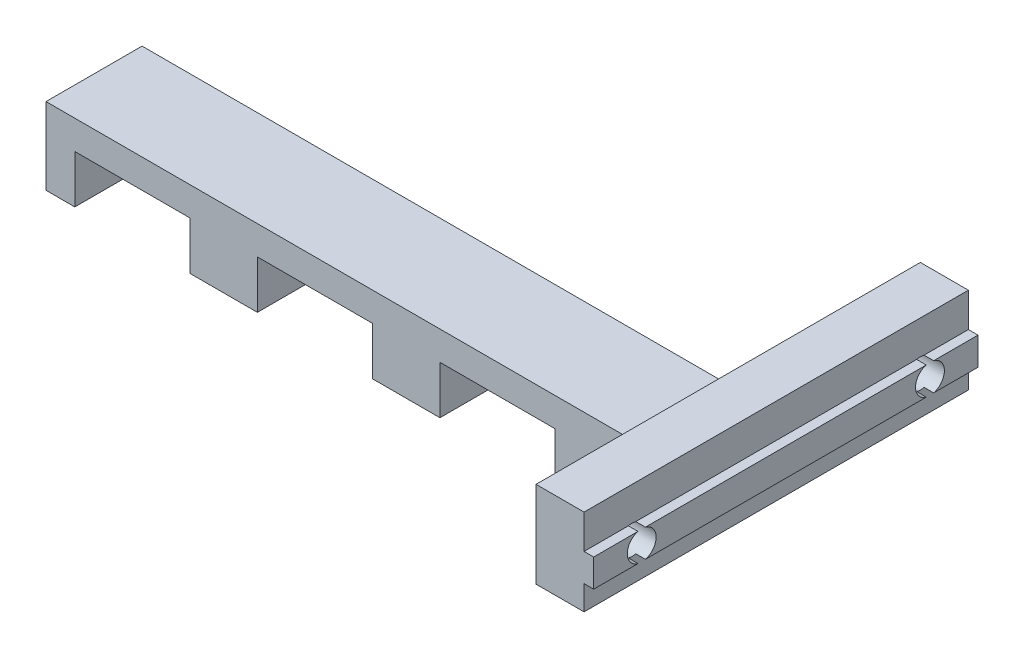
ISO-10303-21;
HEADER;
FILE_DESCRIPTION(('STEP AP214'),'2;1');
FILE_NAME('part.step','',(''),(''),'','','');
FILE_SCHEMA(('AUTOMOTIVE_DESIGN { 1 0 10303 214 1 1 1 1 }'));
ENDSEC;
DATA;
#1=APPLICATION_CONTEXT('core data for automotive mechanical design processes');
#2=APPLICATION_PROTOCOL_DEFINITION('international standard','automotive_design',2000,#1);
#3=PRODUCT_CONTEXT('',#1,'mechanical');
#4=PRODUCT('Part','Part','',(#3));
#5=PRODUCT_RELATED_PRODUCT_CATEGORY('part','',(#4));
#6=PRODUCT_DEFINITION_FORMATION('','',#4);
#7=PRODUCT_DEFINITION_CONTEXT('part definition',#1,'design');
#8=PRODUCT_DEFINITION('design','',#6,#7);
#9=PRODUCT_DEFINITION_SHAPE('','',#8);
#10=(LENGTH_UNIT() NAMED_UNIT(*) SI_UNIT(.MILLI.,.METRE.));
#11=(NAMED_UNIT(*) PLANE_ANGLE_UNIT() SI_UNIT($,.RADIAN.));
#12=(NAMED_UNIT(*) SI_UNIT($,.STERADIAN.) SOLID_ANGLE_UNIT());
#13=UNCERTAINTY_MEASURE_WITH_UNIT(LENGTH_MEASURE(1.E-05),#10,'distance_accuracy_value','');
#14=(GEOMETRIC_REPRESENTATION_CONTEXT(3) GLOBAL_UNCERTAINTY_ASSIGNED_CONTEXT((#13)) GLOBAL_UNIT_ASSIGNED_CONTEXT((#10,
#11,#12)) REPRESENTATION_CONTEXT('',''));
#15=CARTESIAN_POINT('',(0.,0.,0.));
#16=DIRECTION('',(0.,0.,1.));
#17=DIRECTION('',(1.,0.,0.));
#18=AXIS2_PLACEMENT_3D('',#15,#16,#17);
#19=CARTESIAN_POINT('',(72.,10.45,20.));
#20=DIRECTION('',(-1.,0.,0.));
#21=DIRECTION('',(0.,0.,1.));
#22=AXIS2_PLACEMENT_3D('',#19,#20,#21);
#23=PLANE('',#22);
#24=DIRECTION('',(0.,0.,-1.));
#25=VECTOR('',#24,1.);
#26=CARTESIAN_POINT('',(72.,10.45,20.));
#27=LINE('',#26,#25);
#28=CARTESIAN_POINT('',(72.,10.45,-15.3840572873934));
#29=VERTEX_POINT('',#28);
#30=CARTESIAN_POINT('',(72.,10.45,-20.));
#31=VERTEX_POINT('',#30);
#32=EDGE_CURVE('E286',#29,#31,#27,.T.);
#33=ORIENTED_EDGE('',*,*,#32,.F.);
#34=CARTESIAN_POINT('',(72.,9.,-15.));
#35=DIRECTION('',(1.,0.,0.));
#36=DIRECTION('',(0.,0.,-1.));
#37=AXIS2_PLACEMENT_3D('',#34,#35,#36);
#38=CIRCLE('',#37,1.5);
#39=CARTESIAN_POINT('',(72.,7.55,-15.3840572873934));
#40=VERTEX_POINT('',#39);
#41=EDGE_CURVE('E269',#40,#29,#38,.T.);
#42=ORIENTED_EDGE('',*,*,#41,.F.);
#43=DIRECTION('',(0.,0.,-1.));
#44=VECTOR('',#43,1.);
#45=CARTESIAN_POINT('',(72.,7.55,20.));
#46=LINE('',#45,#44);
#47=CARTESIAN_POINT('',(72.,7.55,-20.));
#48=VERTEX_POINT('',#47);
#49=EDGE_CURVE('E304',#40,#48,#46,.T.);
#50=ORIENTED_EDGE('',*,*,#49,.T.);
#51=DIRECTION('',(0.,1.,0.));
#52=VECTOR('',#51,1.);
#53=CARTESIAN_POINT('',(72.,10.45,-20.));
#54=LINE('',#53,#52);
#55=EDGE_CURVE('E292',#48,#31,#54,.T.);
#56=ORIENTED_EDGE('',*,*,#55,.T.);
#57=EDGE_LOOP('',(#33,#42,#50,#56));
#58=FACE_BOUND('',#57,.T.);
#59=ADVANCED_FACE('F33',(#58),#23,.F.);
#60=CARTESIAN_POINT('',(71.,10.45,20.));
#61=DIRECTION('',(0.,-1.,0.));
#62=DIRECTION('',(0.,0.,-1.));
#63=AXIS2_PLACEMENT_3D('',#60,#61,#62);
#64=PLANE('',#63);
#65=DIRECTION('',(0.,0.,-1.));
#66=VECTOR('',#65,1.);
#67=CARTESIAN_POINT('',(71.,10.45,20.));
#68=LINE('',#67,#66);
#69=CARTESIAN_POINT('',(71.,10.45,-15.3840572873934));
#70=VERTEX_POINT('',#69);
#71=CARTESIAN_POINT('',(71.,10.45,-20.));
#72=VERTEX_POINT('',#71);
#73=EDGE_CURVE('E288',#70,#72,#68,.T.);
#74=ORIENTED_EDGE('',*,*,#73,.F.);
#75=DIRECTION('',(1.,0.,0.));
#76=VECTOR('',#75,1.);
#77=CARTESIAN_POINT('',(42.,10.45,-15.3840572873934));
#78=LINE('',#77,#76);
#79=EDGE_CURVE('E273',#70,#29,#78,.T.);
#80=ORIENTED_EDGE('',*,*,#79,.T.);
#81=ORIENTED_EDGE('',*,*,#32,.T.);
#82=DIRECTION('',(-1.,0.,0.));
#83=VECTOR('',#82,1.);
#84=CARTESIAN_POINT('',(71.,10.45,-20.));
#85=LINE('',#84,#83);
#86=EDGE_CURVE('E515',#31,#72,#85,.T.);
#87=ORIENTED_EDGE('',*,*,#86,.T.);
#88=EDGE_LOOP('',(#74,#80,#81,#87));
#89=FACE_BOUND('',#88,.T.);
#90=ADVANCED_FACE('F284',(#89),#64,.F.);
#91=CARTESIAN_POINT('',(72.,7.55,20.));
#92=DIRECTION('',(0.,1.,0.));
#93=DIRECTION('',(0.,0.,1.));
#94=AXIS2_PLACEMENT_3D('',#91,#92,#93);
#95=PLANE('',#94);
#96=DIRECTION('',(0.,0.,-1.));
#97=VECTOR('',#96,1.);
#98=CARTESIAN_POINT('',(71.,7.55,20.));
#99=LINE('',#98,#97);
#100=CARTESIAN_POINT('',(71.,7.55,14.6159427126066));
#101=VERTEX_POINT('',#100);
#102=CARTESIAN_POINT('',(71.,7.55,-14.6159427126066));
#103=VERTEX_POINT('',#102);
#104=EDGE_CURVE('E320',#101,#103,#99,.T.);
#105=ORIENTED_EDGE('',*,*,#104,.T.);
#106=DIRECTION('',(1.,0.,0.));
#107=VECTOR('',#106,1.);
#108=CARTESIAN_POINT('',(42.,7.55,-14.6159427126066));
#109=LINE('',#108,#107);
#110=CARTESIAN_POINT('',(72.,7.55,-14.6159427126066));
#111=VERTEX_POINT('',#110);
#112=EDGE_CURVE('E545',#103,#111,#109,.T.);
#113=ORIENTED_EDGE('',*,*,#112,.T.);
#114=CARTESIAN_POINT('',(72.,7.55,14.6159427126066));
#115=VERTEX_POINT('',#114);
#116=EDGE_CURVE('E309',#115,#111,#46,.T.);
#117=ORIENTED_EDGE('',*,*,#116,.F.);
#118=DIRECTION('',(1.,0.,0.));
#119=VECTOR('',#118,1.);
#120=CARTESIAN_POINT('',(42.,7.55,14.6159427126066));
#121=LINE('',#120,#119);
#122=EDGE_CURVE('E557',#115,#101,#121,.F.);
#123=ORIENTED_EDGE('',*,*,#122,.T.);
#124=EDGE_LOOP('',(#105,#113,#117,#123));
#125=FACE_BOUND('',#124,.T.);
#126=ADVANCED_FACE('F681',(#125),#95,.F.);
#127=CARTESIAN_POINT('',(71.,7.55,20.));
#128=VERTEX_POINT('',#127);
#129=CARTESIAN_POINT('',(71.,7.55,15.3840572873934));
#130=VERTEX_POINT('',#129);
#131=EDGE_CURVE('E321',#128,#130,#99,.T.);
#132=ORIENTED_EDGE('',*,*,#131,.T.);
#133=DIRECTION('',(1.,0.,0.));
#134=VECTOR('',#133,1.);
#135=CARTESIAN_POINT('',(42.,7.55,15.3840572873934));
#136=LINE('',#135,#134);
#137=CARTESIAN_POINT('',(72.,7.55,15.3840572873934));
#138=VERTEX_POINT('',#137);
#139=EDGE_CURVE('E505',#130,#138,#136,.T.);
#140=ORIENTED_EDGE('',*,*,#139,.T.);
#141=CARTESIAN_POINT('',(72.,7.55,20.));
#142=VERTEX_POINT('',#141);
#143=EDGE_CURVE('E310',#142,#138,#46,.T.);
#144=ORIENTED_EDGE('',*,*,#143,.F.);
#145=DIRECTION('',(1.,0.,0.));
#146=VECTOR('',#145,1.);
#147=CARTESIAN_POINT('',(72.,7.55,20.));
#148=LINE('',#147,#146);
#149=EDGE_CURVE('E571',#128,#142,#148,.T.);
#150=ORIENTED_EDGE('',*,*,#149,.F.);
#151=EDGE_LOOP('',(#132,#140,#144,#150));
#152=FACE_BOUND('',#151,.T.);
#153=ADVANCED_FACE('F686',(#152),#95,.F.);
#154=ORIENTED_EDGE('',*,*,#116,.T.);
#155=CARTESIAN_POINT('',(72.,10.45,-14.6159427126066));
#156=VERTEX_POINT('',#155);
#157=EDGE_CURVE('E280',#156,#111,#38,.T.);
#158=ORIENTED_EDGE('',*,*,#157,.F.);
#159=CARTESIAN_POINT('',(72.,10.45,14.6159427126066));
#160=VERTEX_POINT('',#159);
#161=EDGE_CURVE('E294',#160,#156,#27,.T.);
#162=ORIENTED_EDGE('',*,*,#161,.F.);
#163=CARTESIAN_POINT('',(72.,9.,15.));
#164=DIRECTION('',(1.,0.,0.));
#165=DIRECTION('',(0.,0.,-1.));
#166=AXIS2_PLACEMENT_3D('',#163,#164,#165);
#167=CIRCLE('',#166,1.5);
#168=EDGE_CURVE('E551',#115,#160,#167,.T.);
#169=ORIENTED_EDGE('',*,*,#168,.F.);
#170=EDGE_LOOP('',(#154,#158,#162,#169));
#171=FACE_BOUND('',#170,.T.);
#172=ADVANCED_FACE('F676',(#171),#23,.F.);
#173=ORIENTED_EDGE('',*,*,#161,.T.);
#174=DIRECTION('',(1.,0.,0.));
#175=VECTOR('',#174,1.);
#176=CARTESIAN_POINT('',(42.,10.45,-14.6159427126066));
#177=LINE('',#176,#175);
#178=CARTESIAN_POINT('',(71.,10.45,-14.6159427126066));
#179=VERTEX_POINT('',#178);
#180=EDGE_CURVE('E289',#156,#179,#177,.F.);
#181=ORIENTED_EDGE('',*,*,#180,.T.);
#182=CARTESIAN_POINT('',(71.,10.45,14.6159427126066));
#183=VERTEX_POINT('',#182);
#184=EDGE_CURVE('E300',#183,#179,#68,.T.);
#185=ORIENTED_EDGE('',*,*,#184,.F.);
#186=DIRECTION('',(1.,0.,0.));
#187=VECTOR('',#186,1.);
#188=CARTESIAN_POINT('',(42.,10.45,14.6159427126066));
#189=LINE('',#188,#187);
#190=EDGE_CURVE('E536',#183,#160,#189,.T.);
#191=ORIENTED_EDGE('',*,*,#190,.T.);
#192=EDGE_LOOP('',(#173,#181,#185,#191));
#193=FACE_BOUND('',#192,.T.);
#194=ADVANCED_FACE('F535',(#193),#64,.F.);
#195=CARTESIAN_POINT('',(71.,5.,5.));
#196=DIRECTION('',(-1.,0.,0.));
#197=DIRECTION('',(0.,0.,1.));
#198=AXIS2_PLACEMENT_3D('',#195,#196,#197);
#199=PLANE('',#198);
#200=CARTESIAN_POINT('',(71.,7.55,-15.3840572873934));
#201=VERTEX_POINT('',#200);
#202=CARTESIAN_POINT('',(71.,7.55,-20.));
#203=VERTEX_POINT('',#202);
#204=EDGE_CURVE('E315',#201,#203,#99,.T.);
#205=ORIENTED_EDGE('',*,*,#204,.F.);
#206=CARTESIAN_POINT('',(71.,9.,-15.));
#207=DIRECTION('',(-1.,0.,0.));
#208=DIRECTION('',(0.,0.,1.));
#209=AXIS2_PLACEMENT_3D('',#206,#207,#208);
#210=CIRCLE('',#209,1.5);
#211=EDGE_CURVE('E542',#201,#103,#210,.T.);
#212=ORIENTED_EDGE('',*,*,#211,.T.);
#213=ORIENTED_EDGE('',*,*,#104,.F.);
#214=CARTESIAN_POINT('',(71.,9.,15.));
#215=DIRECTION('',(-1.,0.,0.));
#216=DIRECTION('',(0.,0.,1.));
#217=AXIS2_PLACEMENT_3D('',#214,#215,#216);
#218=CIRCLE('',#217,1.5);
#219=EDGE_CURVE('E560',#101,#130,#218,.T.);
#220=ORIENTED_EDGE('',*,*,#219,.T.);
#221=ORIENTED_EDGE('',*,*,#131,.F.);
#222=DIRECTION('',(0.,1.,0.));
#223=VECTOR('',#222,1.);
#224=CARTESIAN_POINT('',(71.,7.55,20.));
#225=LINE('',#224,#223);
#226=CARTESIAN_POINT('',(71.,5.,20.));
#227=VERTEX_POINT('',#226);
#228=EDGE_CURVE('E569',#227,#128,#225,.T.);
#229=ORIENTED_EDGE('',*,*,#228,.F.);
#230=DIRECTION('',(0.,0.,-1.));
#231=VECTOR('',#230,1.);
#232=CARTESIAN_POINT('',(71.,5.,5.));
#233=LINE('',#232,#231);
#234=CARTESIAN_POINT('',(71.,5.,-20.));
#235=VERTEX_POINT('',#234);
#236=EDGE_CURVE('E414',#227,#235,#233,.T.);
#237=ORIENTED_EDGE('',*,*,#236,.T.);
#238=DIRECTION('',(0.,1.,0.));
#239=VECTOR('',#238,1.);
#240=CARTESIAN_POINT('',(71.,7.55,-20.));
#241=LINE('',#240,#239);
#242=EDGE_CURVE('E502',#235,#203,#241,.T.);
#243=ORIENTED_EDGE('',*,*,#242,.T.);
#244=EDGE_LOOP('',(#205,#212,#213,#220,#221,#229,#237,#243));
#245=FACE_BOUND('',#244,.T.);
#246=ADVANCED_FACE('F716',(#245),#199,.F.);
#247=CARTESIAN_POINT('',(71.,8.00000000000001,5.));
#248=DIRECTION('',(0.,-1.,0.));
#249=DIRECTION('',(1.,0.,0.));
#250=AXIS2_PLACEMENT_3D('',#247,#248,#249);
#251=PLANE('',#250);
#252=DIRECTION('',(-1.,0.,0.));
#253=VECTOR('',#252,1.);
#254=CARTESIAN_POINT('',(71.,8.00000000000001,5.));
#255=LINE('',#254,#253);
#256=CARTESIAN_POINT('',(61.,8.00000000000001,5.));
#257=VERTEX_POINT('',#256);
#258=CARTESIAN_POINT('',(0.,8.,5.));
#259=VERTEX_POINT('',#258);
#260=EDGE_CURVE('E371',#257,#259,#255,.T.);
#261=ORIENTED_EDGE('',*,*,#260,.F.);
#262=DIRECTION('',(0.,0.,1.));
#263=VECTOR('',#262,1.);
#264=CARTESIAN_POINT('',(61.,8.00000000000001,-5.));
#265=LINE('',#264,#263);
#266=CARTESIAN_POINT('',(61.,8.00000000000001,-5.));
#267=VERTEX_POINT('',#266);
#268=EDGE_CURVE('E470',#257,#267,#265,.F.);
#269=ORIENTED_EDGE('',*,*,#268,.T.);
#270=DIRECTION('',(-1.,0.,0.));
#271=VECTOR('',#270,1.);
#272=CARTESIAN_POINT('',(71.,8.00000000000001,-5.));
#273=LINE('',#272,#271);
#274=CARTESIAN_POINT('',(0.,8.,-5.));
#275=VERTEX_POINT('',#274);
#276=EDGE_CURVE('E406',#267,#275,#273,.T.);
#277=ORIENTED_EDGE('',*,*,#276,.T.);
#278=DIRECTION('',(0.,0.,-1.));
#279=VECTOR('',#278,1.);
#280=CARTESIAN_POINT('',(0.,8.,5.));
#281=LINE('',#280,#279);
#282=EDGE_CURVE('E411',#259,#275,#281,.T.);
#283=ORIENTED_EDGE('',*,*,#282,.F.);
#284=EDGE_LOOP('',(#261,#269,#277,#283));
#285=FACE_BOUND('',#284,.T.);
#286=ADVANCED_FACE('F590',(#285),#251,.F.);
#287=CARTESIAN_POINT('',(0.,0.,5.));
#288=DIRECTION('',(0.,0.,1.));
#289=DIRECTION('',(1.,0.,0.));
#290=AXIS2_PLACEMENT_3D('',#287,#288,#289);
#291=PLANE('',#290);
#292=DIRECTION('',(1.,0.,0.));
#293=VECTOR('',#292,1.);
#294=CARTESIAN_POINT('',(60.,5.,5.));
#295=LINE('',#294,#293);
#296=CARTESIAN_POINT('',(60.,5.,5.));
#297=VERTEX_POINT('',#296);
#298=CARTESIAN_POINT('',(61.,5.,5.));
#299=VERTEX_POINT('',#298);
#300=EDGE_CURVE('E369',#297,#299,#295,.T.);
#301=ORIENTED_EDGE('',*,*,#300,.T.);
#302=DIRECTION('',(0.,1.,0.));
#303=VECTOR('',#302,1.);
#304=CARTESIAN_POINT('',(61.,0.,5.));
#305=LINE('',#304,#303);
#306=EDGE_CURVE('E472',#299,#257,#305,.T.);
#307=ORIENTED_EDGE('',*,*,#306,.T.);
#308=ORIENTED_EDGE('',*,*,#260,.T.);
#309=DIRECTION('',(0.,-1.,0.));
#310=VECTOR('',#309,1.);
#311=CARTESIAN_POINT('',(0.,8.,5.));
#312=LINE('',#311,#310);
#313=CARTESIAN_POINT('',(0.,0.,5.));
#314=VERTEX_POINT('',#313);
#315=EDGE_CURVE('E373',#259,#314,#312,.T.);
#316=ORIENTED_EDGE('',*,*,#315,.T.);
#317=DIRECTION('',(1.,0.,0.));
#318=VECTOR('',#317,1.);
#319=CARTESIAN_POINT('',(0.,0.,5.));
#320=LINE('',#319,#318);
#321=CARTESIAN_POINT('',(3.,0.,5.));
#322=VERTEX_POINT('',#321);
#323=EDGE_CURVE('E339',#314,#322,#320,.T.);
#324=ORIENTED_EDGE('',*,*,#323,.T.);
#325=DIRECTION('',(0.,1.,0.));
#326=VECTOR('',#325,1.);
#327=CARTESIAN_POINT('',(3.,0.,5.));
#328=LINE('',#327,#326);
#329=CARTESIAN_POINT('',(3.,5.,5.));
#330=VERTEX_POINT('',#329);
#331=EDGE_CURVE('E342',#322,#330,#328,.T.);
#332=ORIENTED_EDGE('',*,*,#331,.T.);
#333=DIRECTION('',(1.,0.,0.));
#334=VECTOR('',#333,1.);
#335=CARTESIAN_POINT('',(3.,5.,5.));
#336=LINE('',#335,#334);
#337=CARTESIAN_POINT('',(15.,5.,5.));
#338=VERTEX_POINT('',#337);
#339=EDGE_CURVE('E345',#330,#338,#336,.T.);
#340=ORIENTED_EDGE('',*,*,#339,.T.);
#341=DIRECTION('',(0.,-1.,0.));
#342=VECTOR('',#341,1.);
#343=CARTESIAN_POINT('',(15.,5.,5.));
#344=LINE('',#343,#342);
#345=CARTESIAN_POINT('',(15.,0.,5.));
#346=VERTEX_POINT('',#345);
#347=EDGE_CURVE('E347',#338,#346,#344,.T.);
#348=ORIENTED_EDGE('',*,*,#347,.T.);
#349=DIRECTION('',(1.,0.,0.));
#350=VECTOR('',#349,1.);
#351=CARTESIAN_POINT('',(15.,0.,5.));
#352=LINE('',#351,#350);
#353=CARTESIAN_POINT('',(22.,0.,5.));
#354=VERTEX_POINT('',#353);
#355=EDGE_CURVE('E349',#346,#354,#352,.T.);
#356=ORIENTED_EDGE('',*,*,#355,.T.);
#357=DIRECTION('',(0.,1.,0.));
#358=VECTOR('',#357,1.);
#359=CARTESIAN_POINT('',(22.,0.,5.));
#360=LINE('',#359,#358);
#361=CARTESIAN_POINT('',(22.,5.,5.));
#362=VERTEX_POINT('',#361);
#363=EDGE_CURVE('E351',#354,#362,#360,.T.);
#364=ORIENTED_EDGE('',*,*,#363,.T.);
#365=DIRECTION('',(1.,0.,0.));
#366=VECTOR('',#365,1.);
#367=CARTESIAN_POINT('',(22.,5.,5.));
#368=LINE('',#367,#366);
#369=CARTESIAN_POINT('',(34.,5.,5.));
#370=VERTEX_POINT('',#369);
#371=EDGE_CURVE('E353',#362,#370,#368,.T.);
#372=ORIENTED_EDGE('',*,*,#371,.T.);
#373=DIRECTION('',(0.,-1.,0.));
#374=VECTOR('',#373,1.);
#375=CARTESIAN_POINT('',(34.,5.,5.));
#376=LINE('',#375,#374);
#377=CARTESIAN_POINT('',(34.,0.,5.));
#378=VERTEX_POINT('',#377);
#379=EDGE_CURVE('E355',#370,#378,#376,.T.);
#380=ORIENTED_EDGE('',*,*,#379,.T.);
#381=DIRECTION('',(1.,0.,0.));
#382=VECTOR('',#381,1.);
#383=CARTESIAN_POINT('',(34.,0.,5.));
#384=LINE('',#383,#382);
#385=CARTESIAN_POINT('',(41.,0.,5.));
#386=VERTEX_POINT('',#385);
#387=EDGE_CURVE('E357',#378,#386,#384,.T.);
#388=ORIENTED_EDGE('',*,*,#387,.T.);
#389=DIRECTION('',(0.,1.,0.));
#390=VECTOR('',#389,1.);
#391=CARTESIAN_POINT('',(41.,0.,5.));
#392=LINE('',#391,#390);
#393=CARTESIAN_POINT('',(41.,5.,5.));
#394=VERTEX_POINT('',#393);
#395=EDGE_CURVE('E359',#386,#394,#392,.T.);
#396=ORIENTED_EDGE('',*,*,#395,.T.);
#397=DIRECTION('',(1.,0.,0.));
#398=VECTOR('',#397,1.);
#399=CARTESIAN_POINT('',(41.,5.,5.));
#400=LINE('',#399,#398);
#401=CARTESIAN_POINT('',(53.,5.,5.));
#402=VERTEX_POINT('',#401);
#403=EDGE_CURVE('E361',#394,#402,#400,.T.);
#404=ORIENTED_EDGE('',*,*,#403,.T.);
#405=DIRECTION('',(0.,-1.,0.));
#406=VECTOR('',#405,1.);
#407=CARTESIAN_POINT('',(53.,5.,5.));
#408=LINE('',#407,#406);
#409=CARTESIAN_POINT('',(53.,0.,5.));
#410=VERTEX_POINT('',#409);
#411=EDGE_CURVE('E363',#402,#410,#408,.T.);
#412=ORIENTED_EDGE('',*,*,#411,.T.);
#413=DIRECTION('',(1.,0.,0.));
#414=VECTOR('',#413,1.);
#415=CARTESIAN_POINT('',(53.,0.,5.));
#416=LINE('',#415,#414);
#417=CARTESIAN_POINT('',(60.,0.,5.));
#418=VERTEX_POINT('',#417);
#419=EDGE_CURVE('E365',#410,#418,#416,.T.);
#420=ORIENTED_EDGE('',*,*,#419,.T.);
#421=DIRECTION('',(0.,1.,0.));
#422=VECTOR('',#421,1.);
#423=CARTESIAN_POINT('',(60.,0.,5.));
#424=LINE('',#423,#422);
#425=EDGE_CURVE('E367',#418,#297,#424,.T.);
#426=ORIENTED_EDGE('',*,*,#425,.T.);
#427=EDGE_LOOP('',(#301,#307,#308,#316,#324,#332,#340,#348,#356,#364,#372,#380,#388,#396,#404,
#412,#420,#426));
#428=FACE_BOUND('',#427,.T.);
#429=ADVANCED_FACE('F587',(#428),#291,.T.);
#430=CARTESIAN_POINT('',(0.,0.,-5.));
#431=DIRECTION('',(0.,0.,1.));
#432=DIRECTION('',(1.,0.,0.));
#433=AXIS2_PLACEMENT_3D('',#430,#431,#432);
#434=PLANE('',#433);
#435=ORIENTED_EDGE('',*,*,#276,.F.);
#436=DIRECTION('',(0.,1.,0.));
#437=VECTOR('',#436,1.);
#438=CARTESIAN_POINT('',(61.,5.,-5.));
#439=LINE('',#438,#437);
#440=CARTESIAN_POINT('',(61.,5.,-5.));
#441=VERTEX_POINT('',#440);
#442=EDGE_CURVE('E50',#267,#441,#439,.F.);
#443=ORIENTED_EDGE('',*,*,#442,.T.);
#444=DIRECTION('',(1.,0.,0.));
#445=VECTOR('',#444,1.);
#446=CARTESIAN_POINT('',(60.,5.,-5.));
#447=LINE('',#446,#445);
#448=CARTESIAN_POINT('',(60.,5.,-5.));
#449=VERTEX_POINT('',#448);
#450=EDGE_CURVE('E404',#449,#441,#447,.T.);
#451=ORIENTED_EDGE('',*,*,#450,.F.);
#452=DIRECTION('',(0.,1.,0.));
#453=VECTOR('',#452,1.);
#454=CARTESIAN_POINT('',(60.,0.,-5.));
#455=LINE('',#454,#453);
#456=CARTESIAN_POINT('',(60.,0.,-5.));
#457=VERTEX_POINT('',#456);
#458=EDGE_CURVE('E402',#457,#449,#455,.T.);
#459=ORIENTED_EDGE('',*,*,#458,.F.);
#460=DIRECTION('',(1.,0.,0.));
#461=VECTOR('',#460,1.);
#462=CARTESIAN_POINT('',(53.,0.,-5.));
#463=LINE('',#462,#461);
#464=CARTESIAN_POINT('',(53.,0.,-5.));
#465=VERTEX_POINT('',#464);
#466=EDGE_CURVE('E400',#465,#457,#463,.T.);
#467=ORIENTED_EDGE('',*,*,#466,.F.);
#468=DIRECTION('',(0.,-1.,0.));
#469=VECTOR('',#468,1.);
#470=CARTESIAN_POINT('',(53.,5.,-5.));
#471=LINE('',#470,#469);
#472=CARTESIAN_POINT('',(53.,5.,-5.));
#473=VERTEX_POINT('',#472);
#474=EDGE_CURVE('E398',#473,#465,#471,.T.);
#475=ORIENTED_EDGE('',*,*,#474,.F.);
#476=DIRECTION('',(1.,0.,0.));
#477=VECTOR('',#476,1.);
#478=CARTESIAN_POINT('',(41.,5.,-5.));
#479=LINE('',#478,#477);
#480=CARTESIAN_POINT('',(41.,5.,-5.));
#481=VERTEX_POINT('',#480);
#482=EDGE_CURVE('E396',#481,#473,#479,.T.);
#483=ORIENTED_EDGE('',*,*,#482,.F.);
#484=DIRECTION('',(0.,1.,0.));
#485=VECTOR('',#484,1.);
#486=CARTESIAN_POINT('',(41.,0.,-5.));
#487=LINE('',#486,#485);
#488=CARTESIAN_POINT('',(41.,0.,-5.));
#489=VERTEX_POINT('',#488);
#490=EDGE_CURVE('E394',#489,#481,#487,.T.);
#491=ORIENTED_EDGE('',*,*,#490,.F.);
#492=DIRECTION('',(1.,0.,0.));
#493=VECTOR('',#492,1.);
#494=CARTESIAN_POINT('',(34.,0.,-5.));
#495=LINE('',#494,#493);
#496=CARTESIAN_POINT('',(34.,0.,-5.));
#497=VERTEX_POINT('',#496);
#498=EDGE_CURVE('E392',#497,#489,#495,.T.);
#499=ORIENTED_EDGE('',*,*,#498,.F.);
#500=DIRECTION('',(0.,-1.,0.));
#501=VECTOR('',#500,1.);
#502=CARTESIAN_POINT('',(34.,5.,-5.));
#503=LINE('',#502,#501);
#504=CARTESIAN_POINT('',(34.,5.,-5.));
#505=VERTEX_POINT('',#504);
#506=EDGE_CURVE('E390',#505,#497,#503,.T.);
#507=ORIENTED_EDGE('',*,*,#506,.F.);
#508=DIRECTION('',(1.,0.,0.));
#509=VECTOR('',#508,1.);
#510=CARTESIAN_POINT('',(22.,5.,-5.));
#511=LINE('',#510,#509);
#512=CARTESIAN_POINT('',(22.,5.,-5.));
#513=VERTEX_POINT('',#512);
#514=EDGE_CURVE('E388',#513,#505,#511,.T.);
#515=ORIENTED_EDGE('',*,*,#514,.F.);
#516=DIRECTION('',(0.,1.,0.));
#517=VECTOR('',#516,1.);
#518=CARTESIAN_POINT('',(22.,0.,-5.));
#519=LINE('',#518,#517);
#520=CARTESIAN_POINT('',(22.,0.,-5.));
#521=VERTEX_POINT('',#520);
#522=EDGE_CURVE('E386',#521,#513,#519,.T.);
#523=ORIENTED_EDGE('',*,*,#522,.F.);
#524=DIRECTION('',(1.,0.,0.));
#525=VECTOR('',#524,1.);
#526=CARTESIAN_POINT('',(15.,0.,-5.));
#527=LINE('',#526,#525);
#528=CARTESIAN_POINT('',(15.,0.,-5.));
#529=VERTEX_POINT('',#528);
#530=EDGE_CURVE('E384',#529,#521,#527,.T.);
#531=ORIENTED_EDGE('',*,*,#530,.F.);
#532=DIRECTION('',(0.,-1.,0.));
#533=VECTOR('',#532,1.);
#534=CARTESIAN_POINT('',(15.,5.,-5.));
#535=LINE('',#534,#533);
#536=CARTESIAN_POINT('',(15.,5.,-5.));
#537=VERTEX_POINT('',#536);
#538=EDGE_CURVE('E382',#537,#529,#535,.T.);
#539=ORIENTED_EDGE('',*,*,#538,.F.);
#540=DIRECTION('',(1.,0.,0.));
#541=VECTOR('',#540,1.);
#542=CARTESIAN_POINT('',(3.,5.,-5.));
#543=LINE('',#542,#541);
#544=CARTESIAN_POINT('',(3.,5.,-5.));
#545=VERTEX_POINT('',#544);
#546=EDGE_CURVE('E380',#545,#537,#543,.T.);
#547=ORIENTED_EDGE('',*,*,#546,.F.);
#548=DIRECTION('',(0.,1.,0.));
#549=VECTOR('',#548,1.);
#550=CARTESIAN_POINT('',(3.,0.,-5.));
#551=LINE('',#550,#549);
#552=CARTESIAN_POINT('',(3.,0.,-5.));
#553=VERTEX_POINT('',#552);
#554=EDGE_CURVE('E378',#553,#545,#551,.T.);
#555=ORIENTED_EDGE('',*,*,#554,.F.);
#556=DIRECTION('',(1.,0.,0.));
#557=VECTOR('',#556,1.);
#558=CARTESIAN_POINT('',(0.,0.,-5.));
#559=LINE('',#558,#557);
#560=CARTESIAN_POINT('',(0.,0.,-5.));
#561=VERTEX_POINT('',#560);
#562=EDGE_CURVE('E337',#561,#553,#559,.T.);
#563=ORIENTED_EDGE('',*,*,#562,.F.);
#564=DIRECTION('',(0.,-1.,0.));
#565=VECTOR('',#564,1.);
#566=CARTESIAN_POINT('',(0.,8.,-5.));
#567=LINE('',#566,#565);
#568=EDGE_CURVE('E343',#275,#561,#567,.T.);
#569=ORIENTED_EDGE('',*,*,#568,.F.);
#570=EDGE_LOOP('',(#435,#443,#451,#459,#467,#475,#483,#491,#499,#507,#515,#523,#531,#539,#547,
#555,#563,#569));
#571=FACE_BOUND('',#570,.T.);
#572=ADVANCED_FACE('F664',(#571),#434,.F.);
#573=CARTESIAN_POINT('',(0.,0.,5.));
#574=DIRECTION('',(0.,1.,0.));
#575=DIRECTION('',(0.,0.,1.));
#576=AXIS2_PLACEMENT_3D('',#573,#574,#575);
#577=PLANE('',#576);
#578=ORIENTED_EDGE('',*,*,#562,.T.);
#579=DIRECTION('',(0.,0.,-1.));
#580=VECTOR('',#579,1.);
#581=CARTESIAN_POINT('',(3.,0.,5.));
#582=LINE('',#581,#580);
#583=EDGE_CURVE('E455',#322,#553,#582,.T.);
#584=ORIENTED_EDGE('',*,*,#583,.F.);
#585=ORIENTED_EDGE('',*,*,#323,.F.);
#586=DIRECTION('',(0.,0.,-1.));
#587=VECTOR('',#586,1.);
#588=CARTESIAN_POINT('',(0.,0.,5.));
#589=LINE('',#588,#587);
#590=EDGE_CURVE('E375',#314,#561,#589,.T.);
#591=ORIENTED_EDGE('',*,*,#590,.T.);
#592=EDGE_LOOP('',(#578,#584,#585,#591));
#593=FACE_BOUND('',#592,.T.);
#594=ADVANCED_FACE('F600',(#593),#577,.F.);
#595=CARTESIAN_POINT('',(3.,0.,5.));
#596=DIRECTION('',(-1.,0.,0.));
#597=DIRECTION('',(0.,0.,1.));
#598=AXIS2_PLACEMENT_3D('',#595,#596,#597);
#599=PLANE('',#598);
#600=ORIENTED_EDGE('',*,*,#554,.T.);
#601=DIRECTION('',(0.,0.,-1.));
#602=VECTOR('',#601,1.);
#603=CARTESIAN_POINT('',(3.,5.,5.));
#604=LINE('',#603,#602);
#605=EDGE_CURVE('E452',#330,#545,#604,.T.);
#606=ORIENTED_EDGE('',*,*,#605,.F.);
#607=ORIENTED_EDGE('',*,*,#331,.F.);
#608=ORIENTED_EDGE('',*,*,#583,.T.);
#609=EDGE_LOOP('',(#600,#606,#607,#608));
#610=FACE_BOUND('',#609,.T.);
#611=ADVANCED_FACE('F603',(#610),#599,.F.);
#612=CARTESIAN_POINT('',(3.,5.,5.));
#613=DIRECTION('',(0.,1.,0.));
#614=DIRECTION('',(0.,0.,1.));
#615=AXIS2_PLACEMENT_3D('',#612,#613,#614);
#616=PLANE('',#615);
#617=ORIENTED_EDGE('',*,*,#546,.T.);
#618=DIRECTION('',(0.,0.,-1.));
#619=VECTOR('',#618,1.);
#620=CARTESIAN_POINT('',(15.,5.,5.));
#621=LINE('',#620,#619);
#622=EDGE_CURVE('E449',#338,#537,#621,.T.);
#623=ORIENTED_EDGE('',*,*,#622,.F.);
#624=ORIENTED_EDGE('',*,*,#339,.F.);
#625=ORIENTED_EDGE('',*,*,#605,.T.);
#626=EDGE_LOOP('',(#617,#623,#624,#625));
#627=FACE_BOUND('',#626,.T.);
#628=ADVANCED_FACE('F608',(#627),#616,.F.);
#629=CARTESIAN_POINT('',(15.,5.,5.));
#630=DIRECTION('',(1.,0.,0.));
#631=DIRECTION('',(0.,1.,0.));
#632=AXIS2_PLACEMENT_3D('',#629,#630,#631);
#633=PLANE('',#632);
#634=ORIENTED_EDGE('',*,*,#538,.T.);
#635=DIRECTION('',(0.,0.,-1.));
#636=VECTOR('',#635,1.);
#637=CARTESIAN_POINT('',(15.,0.,5.));
#638=LINE('',#637,#636);
#639=EDGE_CURVE('E446',#346,#529,#638,.T.);
#640=ORIENTED_EDGE('',*,*,#639,.F.);
#641=ORIENTED_EDGE('',*,*,#347,.F.);
#642=ORIENTED_EDGE('',*,*,#622,.T.);
#643=EDGE_LOOP('',(#634,#640,#641,#642));
#644=FACE_BOUND('',#643,.T.);
#645=ADVANCED_FACE('F614',(#644),#633,.F.);
#646=CARTESIAN_POINT('',(15.,0.,5.));
#647=DIRECTION('',(0.,1.,0.));
#648=DIRECTION('',(-1.,0.,0.));
#649=AXIS2_PLACEMENT_3D('',#646,#647,#648);
#650=PLANE('',#649);
#651=ORIENTED_EDGE('',*,*,#530,.T.);
#652=DIRECTION('',(0.,0.,-1.));
#653=VECTOR('',#652,1.);
#654=CARTESIAN_POINT('',(22.,0.,5.));
#655=LINE('',#654,#653);
#656=EDGE_CURVE('E443',#354,#521,#655,.T.);
#657=ORIENTED_EDGE('',*,*,#656,.F.);
#658=ORIENTED_EDGE('',*,*,#355,.F.);
#659=ORIENTED_EDGE('',*,*,#639,.T.);
#660=EDGE_LOOP('',(#651,#657,#658,#659));
#661=FACE_BOUND('',#660,.T.);
#662=ADVANCED_FACE('F618',(#661),#650,.F.);
#663=CARTESIAN_POINT('',(22.,0.,5.));
#664=DIRECTION('',(-1.,0.,0.));
#665=DIRECTION('',(0.,-1.,0.));
#666=AXIS2_PLACEMENT_3D('',#663,#664,#665);
#667=PLANE('',#666);
#668=ORIENTED_EDGE('',*,*,#522,.T.);
#669=DIRECTION('',(0.,0.,-1.));
#670=VECTOR('',#669,1.);
#671=CARTESIAN_POINT('',(22.,5.,5.));
#672=LINE('',#671,#670);
#673=EDGE_CURVE('E440',#362,#513,#672,.T.);
#674=ORIENTED_EDGE('',*,*,#673,.F.);
#675=ORIENTED_EDGE('',*,*,#363,.F.);
#676=ORIENTED_EDGE('',*,*,#656,.T.);
#677=EDGE_LOOP('',(#668,#674,#675,#676));
#678=FACE_BOUND('',#677,.T.);
#679=ADVANCED_FACE('F623',(#678),#667,.F.);
#680=CARTESIAN_POINT('',(22.,5.,5.));
#681=DIRECTION('',(0.,1.,0.));
#682=DIRECTION('',(0.,0.,1.));
#683=AXIS2_PLACEMENT_3D('',#680,#681,#682);
#684=PLANE('',#683);
#685=ORIENTED_EDGE('',*,*,#514,.T.);
#686=DIRECTION('',(0.,0.,-1.));
#687=VECTOR('',#686,1.);
#688=CARTESIAN_POINT('',(34.,5.,5.));
#689=LINE('',#688,#687);
#690=EDGE_CURVE('E437',#370,#505,#689,.T.);
#691=ORIENTED_EDGE('',*,*,#690,.F.);
#692=ORIENTED_EDGE('',*,*,#371,.F.);
#693=ORIENTED_EDGE('',*,*,#673,.T.);
#694=EDGE_LOOP('',(#685,#691,#692,#693));
#695=FACE_BOUND('',#694,.T.);
#696=ADVANCED_FACE('F629',(#695),#684,.F.);
#697=CARTESIAN_POINT('',(34.,5.,5.));
#698=DIRECTION('',(1.,0.,0.));
#699=DIRECTION('',(0.,1.,0.));
#700=AXIS2_PLACEMENT_3D('',#697,#698,#699);
#701=PLANE('',#700);
#702=ORIENTED_EDGE('',*,*,#506,.T.);
#703=DIRECTION('',(0.,0.,-1.));
#704=VECTOR('',#703,1.);
#705=CARTESIAN_POINT('',(34.,0.,5.));
#706=LINE('',#705,#704);
#707=EDGE_CURVE('E434',#378,#497,#706,.T.);
#708=ORIENTED_EDGE('',*,*,#707,.F.);
#709=ORIENTED_EDGE('',*,*,#379,.F.);
#710=ORIENTED_EDGE('',*,*,#690,.T.);
#711=EDGE_LOOP('',(#702,#708,#709,#710));
#712=FACE_BOUND('',#711,.T.);
#713=ADVANCED_FACE('F633',(#712),#701,.F.);
#714=CARTESIAN_POINT('',(34.,0.,5.));
#715=DIRECTION('',(0.,1.,0.));
#716=DIRECTION('',(0.,0.,1.));
#717=AXIS2_PLACEMENT_3D('',#714,#715,#716);
#718=PLANE('',#717);
#719=ORIENTED_EDGE('',*,*,#498,.T.);
#720=DIRECTION('',(0.,0.,-1.));
#721=VECTOR('',#720,1.);
#722=CARTESIAN_POINT('',(41.,0.,5.));
#723=LINE('',#722,#721);
#724=EDGE_CURVE('E431',#386,#489,#723,.T.);
#725=ORIENTED_EDGE('',*,*,#724,.F.);
#726=ORIENTED_EDGE('',*,*,#387,.F.);
#727=ORIENTED_EDGE('',*,*,#707,.T.);
#728=EDGE_LOOP('',(#719,#725,#726,#727));
#729=FACE_BOUND('',#728,.T.);
#730=ADVANCED_FACE('F638',(#729),#718,.F.);
#731=CARTESIAN_POINT('',(41.,0.,5.));
#732=DIRECTION('',(-1.,0.,0.));
#733=DIRECTION('',(0.,-1.,0.));
#734=AXIS2_PLACEMENT_3D('',#731,#732,#733);
#735=PLANE('',#734);
#736=ORIENTED_EDGE('',*,*,#490,.T.);
#737=DIRECTION('',(0.,0.,-1.));
#738=VECTOR('',#737,1.);
#739=CARTESIAN_POINT('',(41.,5.,5.));
#740=LINE('',#739,#738);
#741=EDGE_CURVE('E428',#394,#481,#740,.T.);
#742=ORIENTED_EDGE('',*,*,#741,.F.);
#743=ORIENTED_EDGE('',*,*,#395,.F.);
#744=ORIENTED_EDGE('',*,*,#724,.T.);
#745=EDGE_LOOP('',(#736,#742,#743,#744));
#746=FACE_BOUND('',#745,.T.);
#747=ADVANCED_FACE('F644',(#746),#735,.F.);
#748=CARTESIAN_POINT('',(41.,5.,5.));
#749=DIRECTION('',(0.,1.,0.));
#750=DIRECTION('',(0.,0.,1.));
#751=AXIS2_PLACEMENT_3D('',#748,#749,#750);
#752=PLANE('',#751);
#753=ORIENTED_EDGE('',*,*,#482,.T.);
#754=DIRECTION('',(0.,0.,-1.));
#755=VECTOR('',#754,1.);
#756=CARTESIAN_POINT('',(53.,5.,5.));
#757=LINE('',#756,#755);
#758=EDGE_CURVE('E425',#402,#473,#757,.T.);
#759=ORIENTED_EDGE('',*,*,#758,.F.);
#760=ORIENTED_EDGE('',*,*,#403,.F.);
#761=ORIENTED_EDGE('',*,*,#741,.T.);
#762=EDGE_LOOP('',(#753,#759,#760,#761));
#763=FACE_BOUND('',#762,.T.);
#764=ADVANCED_FACE('F648',(#763),#752,.F.);
#765=CARTESIAN_POINT('',(53.,5.,5.));
#766=DIRECTION('',(1.,0.,0.));
#767=DIRECTION('',(0.,1.,0.));
#768=AXIS2_PLACEMENT_3D('',#765,#766,#767);
#769=PLANE('',#768);
#770=ORIENTED_EDGE('',*,*,#474,.T.);
#771=DIRECTION('',(0.,0.,-1.));
#772=VECTOR('',#771,1.);
#773=CARTESIAN_POINT('',(53.,0.,5.));
#774=LINE('',#773,#772);
#775=EDGE_CURVE('E422',#410,#465,#774,.T.);
#776=ORIENTED_EDGE('',*,*,#775,.F.);
#777=ORIENTED_EDGE('',*,*,#411,.F.);
#778=ORIENTED_EDGE('',*,*,#758,.T.);
#779=EDGE_LOOP('',(#770,#776,#777,#778));
#780=FACE_BOUND('',#779,.T.);
#781=ADVANCED_FACE('F653',(#780),#769,.F.);
#782=CARTESIAN_POINT('',(53.,0.,5.));
#783=DIRECTION('',(0.,1.,0.));
#784=DIRECTION('',(0.,0.,1.));
#785=AXIS2_PLACEMENT_3D('',#782,#783,#784);
#786=PLANE('',#785);
#787=ORIENTED_EDGE('',*,*,#466,.T.);
#788=DIRECTION('',(0.,0.,-1.));
#789=VECTOR('',#788,1.);
#790=CARTESIAN_POINT('',(60.,0.,5.));
#791=LINE('',#790,#789);
#792=EDGE_CURVE('E419',#418,#457,#791,.T.);
#793=ORIENTED_EDGE('',*,*,#792,.F.);
#794=ORIENTED_EDGE('',*,*,#419,.F.);
#795=ORIENTED_EDGE('',*,*,#775,.T.);
#796=EDGE_LOOP('',(#787,#793,#794,#795));
#797=FACE_BOUND('',#796,.T.);
#798=ADVANCED_FACE('F659',(#797),#786,.F.);
#799=CARTESIAN_POINT('',(60.,0.,5.));
#800=DIRECTION('',(-1.,0.,0.));
#801=DIRECTION('',(0.,-1.,0.));
#802=AXIS2_PLACEMENT_3D('',#799,#800,#801);
#803=PLANE('',#802);
#804=ORIENTED_EDGE('',*,*,#458,.T.);
#805=DIRECTION('',(0.,0.,-1.));
#806=VECTOR('',#805,1.);
#807=CARTESIAN_POINT('',(60.,5.,5.));
#808=LINE('',#807,#806);
#809=EDGE_CURVE('E416',#297,#449,#808,.T.);
#810=ORIENTED_EDGE('',*,*,#809,.F.);
#811=ORIENTED_EDGE('',*,*,#425,.F.);
#812=ORIENTED_EDGE('',*,*,#792,.T.);
#813=EDGE_LOOP('',(#804,#810,#811,#812));
#814=FACE_BOUND('',#813,.T.);
#815=ADVANCED_FACE('F663',(#814),#803,.F.);
#816=CARTESIAN_POINT('',(60.,5.,5.));
#817=DIRECTION('',(0.,1.,0.));
#818=DIRECTION('',(0.,0.,1.));
#819=AXIS2_PLACEMENT_3D('',#816,#817,#818);
#820=PLANE('',#819);
#821=ORIENTED_EDGE('',*,*,#236,.F.);
#822=DIRECTION('',(1.,0.,0.));
#823=VECTOR('',#822,1.);
#824=CARTESIAN_POINT('',(71.,5.,20.));
#825=LINE('',#824,#823);
#826=CARTESIAN_POINT('',(66.,5.,20.));
#827=VERTEX_POINT('',#826);
#828=EDGE_CURVE('E566',#827,#227,#825,.T.);
#829=ORIENTED_EDGE('',*,*,#828,.F.);
#830=DIRECTION('',(0.,0.,-1.));
#831=VECTOR('',#830,1.);
#832=CARTESIAN_POINT('',(66.,5.,20.));
#833=LINE('',#832,#831);
#834=CARTESIAN_POINT('',(66.,5.,10.));
#835=VERTEX_POINT('',#834);
#836=EDGE_CURVE('E333',#827,#835,#833,.T.);
#837=ORIENTED_EDGE('',*,*,#836,.T.);
#838=CARTESIAN_POINT('',(61.,5.,10.));
#839=DIRECTION('',(0.,1.,0.));
#840=DIRECTION('',(0.,0.,1.));
#841=AXIS2_PLACEMENT_3D('',#838,#839,#840);
#842=CIRCLE('',#841,5.);
#843=EDGE_CURVE('E42',#835,#299,#842,.T.);
#844=ORIENTED_EDGE('',*,*,#843,.T.);
#845=ORIENTED_EDGE('',*,*,#300,.F.);
#846=ORIENTED_EDGE('',*,*,#809,.T.);
#847=ORIENTED_EDGE('',*,*,#450,.T.);
#848=CARTESIAN_POINT('',(61.,5.,-10.));
#849=DIRECTION('',(0.,1.,0.));
#850=DIRECTION('',(0.,0.,1.));
#851=AXIS2_PLACEMENT_3D('',#848,#849,#850);
#852=CIRCLE('',#851,5.);
#853=CARTESIAN_POINT('',(66.,5.,-10.));
#854=VERTEX_POINT('',#853);
#855=EDGE_CURVE('E11',#441,#854,#852,.T.);
#856=ORIENTED_EDGE('',*,*,#855,.T.);
#857=CARTESIAN_POINT('',(66.,5.,-20.));
#858=VERTEX_POINT('',#857);
#859=EDGE_CURVE('E328',#854,#858,#833,.T.);
#860=ORIENTED_EDGE('',*,*,#859,.T.);
#861=DIRECTION('',(1.,0.,0.));
#862=VECTOR('',#861,1.);
#863=CARTESIAN_POINT('',(71.,5.,-20.));
#864=LINE('',#863,#862);
#865=EDGE_CURVE('E499',#858,#235,#864,.T.);
#866=ORIENTED_EDGE('',*,*,#865,.T.);
#867=EDGE_LOOP('',(#821,#829,#837,#844,#845,#846,#847,#856,#860,#866));
#868=FACE_BOUND('',#867,.T.);
#869=ADVANCED_FACE('F487',(#868),#820,.F.);
#870=CARTESIAN_POINT('',(0.,8.,5.));
#871=DIRECTION('',(1.,0.,0.));
#872=DIRECTION('',(0.,1.,0.));
#873=AXIS2_PLACEMENT_3D('',#870,#871,#872);
#874=PLANE('',#873);
#875=ORIENTED_EDGE('',*,*,#568,.T.);
#876=ORIENTED_EDGE('',*,*,#590,.F.);
#877=ORIENTED_EDGE('',*,*,#315,.F.);
#878=ORIENTED_EDGE('',*,*,#282,.T.);
#879=EDGE_LOOP('',(#875,#876,#877,#878));
#880=FACE_BOUND('',#879,.T.);
#881=ADVANCED_FACE('F595',(#880),#874,.F.);
#882=CARTESIAN_POINT('',(66.,5.,20.));
#883=DIRECTION('',(1.,0.,0.));
#884=DIRECTION('',(0.,0.,-1.));
#885=AXIS2_PLACEMENT_3D('',#882,#883,#884);
#886=PLANE('',#885);
#887=CARTESIAN_POINT('',(66.,9.,-15.));
#888=DIRECTION('',(1.,0.,0.));
#889=DIRECTION('',(0.,0.,-1.));
#890=AXIS2_PLACEMENT_3D('',#887,#888,#889);
#891=CIRCLE('',#890,1.5);
#892=CARTESIAN_POINT('',(66.,9.,-16.5));
#893=VERTEX_POINT('',#892);
#894=EDGE_CURVE('E548',#893,#893,#891,.T.);
#895=ORIENTED_EDGE('',*,*,#894,.T.);
#896=EDGE_LOOP('',(#895));
#897=FACE_BOUND('',#896,.T.);
#898=CARTESIAN_POINT('',(66.,9.,15.));
#899=DIRECTION('',(1.,0.,0.));
#900=DIRECTION('',(0.,0.,-1.));
#901=AXIS2_PLACEMENT_3D('',#898,#899,#900);
#902=CIRCLE('',#901,1.5);
#903=CARTESIAN_POINT('',(66.,9.,13.5));
#904=VERTEX_POINT('',#903);
#905=EDGE_CURVE('E500',#904,#904,#902,.T.);
#906=ORIENTED_EDGE('',*,*,#905,.T.);
#907=EDGE_LOOP('',(#906));
#908=FACE_BOUND('',#907,.T.);
#909=DIRECTION('',(0.,0.,1.));
#910=VECTOR('',#909,1.);
#911=CARTESIAN_POINT('',(66.,13.,5.));
#912=LINE('',#911,#910);
#913=CARTESIAN_POINT('',(66.,13.,-10.));
#914=VERTEX_POINT('',#913);
#915=CARTESIAN_POINT('',(66.,13.,10.));
#916=VERTEX_POINT('',#915);
#917=EDGE_CURVE('E465',#914,#916,#912,.T.);
#918=ORIENTED_EDGE('',*,*,#917,.T.);
#919=DIRECTION('',(0.,1.,0.));
#920=VECTOR('',#919,1.);
#921=CARTESIAN_POINT('',(66.,5.,10.));
#922=LINE('',#921,#920);
#923=EDGE_CURVE('E468',#916,#835,#922,.F.);
#924=ORIENTED_EDGE('',*,*,#923,.T.);
#925=ORIENTED_EDGE('',*,*,#836,.F.);
#926=DIRECTION('',(0.,-1.,0.));
#927=VECTOR('',#926,1.);
#928=CARTESIAN_POINT('',(66.,5.,20.));
#929=LINE('',#928,#927);
#930=CARTESIAN_POINT('',(66.,14.,20.));
#931=VERTEX_POINT('',#930);
#932=EDGE_CURVE('E521',#931,#827,#929,.T.);
#933=ORIENTED_EDGE('',*,*,#932,.F.);
#934=DIRECTION('',(0.,0.,-1.));
#935=VECTOR('',#934,1.);
#936=CARTESIAN_POINT('',(66.,14.,20.));
#937=LINE('',#936,#935);
#938=CARTESIAN_POINT('',(66.,14.,-20.));
#939=VERTEX_POINT('',#938);
#940=EDGE_CURVE('E496',#931,#939,#937,.T.);
#941=ORIENTED_EDGE('',*,*,#940,.T.);
#942=DIRECTION('',(0.,-1.,0.));
#943=VECTOR('',#942,1.);
#944=CARTESIAN_POINT('',(66.,5.,-20.));
#945=LINE('',#944,#943);
#946=EDGE_CURVE('E493',#939,#858,#945,.T.);
#947=ORIENTED_EDGE('',*,*,#946,.T.);
#948=ORIENTED_EDGE('',*,*,#859,.F.);
#949=DIRECTION('',(0.,1.,0.));
#950=VECTOR('',#949,1.);
#951=CARTESIAN_POINT('',(66.,8.00000000000001,-10.));
#952=LINE('',#951,#950);
#953=EDGE_CURVE('E463',#854,#914,#952,.T.);
#954=ORIENTED_EDGE('',*,*,#953,.T.);
#955=EDGE_LOOP('',(#918,#924,#925,#933,#941,#947,#948,#954));
#956=FACE_BOUND('',#955,.T.);
#957=ADVANCED_FACE('F490',(#897,#908,#956),#886,.F.);
#958=ORIENTED_EDGE('',*,*,#49,.F.);
#959=DIRECTION('',(1.,0.,0.));
#960=VECTOR('',#959,1.);
#961=CARTESIAN_POINT('',(42.,7.55,-15.3840572873934));
#962=LINE('',#961,#960);
#963=EDGE_CURVE('E276',#40,#201,#962,.F.);
#964=ORIENTED_EDGE('',*,*,#963,.T.);
#965=ORIENTED_EDGE('',*,*,#204,.T.);
#966=DIRECTION('',(1.,0.,0.));
#967=VECTOR('',#966,1.);
#968=CARTESIAN_POINT('',(72.,7.55,-20.));
#969=LINE('',#968,#967);
#970=EDGE_CURVE('E512',#203,#48,#969,.T.);
#971=ORIENTED_EDGE('',*,*,#970,.T.);
#972=EDGE_LOOP('',(#958,#964,#965,#971));
#973=FACE_BOUND('',#972,.T.);
#974=ADVANCED_FACE('F689',(#973),#95,.F.);
#975=ORIENTED_EDGE('',*,*,#143,.T.);
#976=CARTESIAN_POINT('',(72.,10.45,15.3840572873934));
#977=VERTEX_POINT('',#976);
#978=EDGE_CURVE('E553',#977,#138,#167,.T.);
#979=ORIENTED_EDGE('',*,*,#978,.F.);
#980=CARTESIAN_POINT('',(72.,10.45,20.));
#981=VERTEX_POINT('',#980);
#982=EDGE_CURVE('E297',#981,#977,#27,.T.);
#983=ORIENTED_EDGE('',*,*,#982,.F.);
#984=DIRECTION('',(0.,1.,0.));
#985=VECTOR('',#984,1.);
#986=CARTESIAN_POINT('',(72.,10.45,20.));
#987=LINE('',#986,#985);
#988=EDGE_CURVE('E573',#142,#981,#987,.T.);
#989=ORIENTED_EDGE('',*,*,#988,.F.);
#990=EDGE_LOOP('',(#975,#979,#983,#989));
#991=FACE_BOUND('',#990,.T.);
#992=ADVANCED_FACE('F677',(#991),#23,.F.);
#993=ORIENTED_EDGE('',*,*,#982,.T.);
#994=DIRECTION('',(1.,0.,0.));
#995=VECTOR('',#994,1.);
#996=CARTESIAN_POINT('',(42.,10.45,15.3840572873934));
#997=LINE('',#996,#995);
#998=CARTESIAN_POINT('',(71.,10.45,15.3840572873934));
#999=VERTEX_POINT('',#998);
#1000=EDGE_CURVE('E554',#977,#999,#997,.F.);
#1001=ORIENTED_EDGE('',*,*,#1000,.T.);
#1002=CARTESIAN_POINT('',(71.,10.45,20.));
#1003=VERTEX_POINT('',#1002);
#1004=EDGE_CURVE('E295',#1003,#999,#68,.T.);
#1005=ORIENTED_EDGE('',*,*,#1004,.F.);
#1006=DIRECTION('',(-1.,0.,0.));
#1007=VECTOR('',#1006,1.);
#1008=CARTESIAN_POINT('',(71.,10.45,20.));
#1009=LINE('',#1008,#1007);
#1010=EDGE_CURVE('E575',#981,#1003,#1009,.T.);
#1011=ORIENTED_EDGE('',*,*,#1010,.F.);
#1012=EDGE_LOOP('',(#993,#1001,#1005,#1011));
#1013=FACE_BOUND('',#1012,.T.);
#1014=ADVANCED_FACE('F683',(#1013),#64,.F.);
#1015=CARTESIAN_POINT('',(71.,14.,20.));
#1016=DIRECTION('',(-1.,0.,0.));
#1017=DIRECTION('',(0.,0.,1.));
#1018=AXIS2_PLACEMENT_3D('',#1015,#1016,#1017);
#1019=PLANE('',#1018);
#1020=ORIENTED_EDGE('',*,*,#184,.T.);
#1021=CARTESIAN_POINT('',(71.,9.,-15.));
#1022=DIRECTION('',(-1.,0.,0.));
#1023=DIRECTION('',(0.,0.,1.));
#1024=AXIS2_PLACEMENT_3D('',#1021,#1022,#1023);
#1025=CIRCLE('',#1024,1.5);
#1026=EDGE_CURVE('E461',#179,#70,#1025,.T.);
#1027=ORIENTED_EDGE('',*,*,#1026,.T.);
#1028=ORIENTED_EDGE('',*,*,#73,.T.);
#1029=DIRECTION('',(0.,1.,0.));
#1030=VECTOR('',#1029,1.);
#1031=CARTESIAN_POINT('',(71.,14.,-20.));
#1032=LINE('',#1031,#1030);
#1033=CARTESIAN_POINT('',(71.,14.,-20.));
#1034=VERTEX_POINT('',#1033);
#1035=EDGE_CURVE('E517',#72,#1034,#1032,.T.);
#1036=ORIENTED_EDGE('',*,*,#1035,.T.);
#1037=DIRECTION('',(0.,0.,-1.));
#1038=VECTOR('',#1037,1.);
#1039=CARTESIAN_POINT('',(71.,14.,20.));
#1040=LINE('',#1039,#1038);
#1041=CARTESIAN_POINT('',(71.,14.,20.));
#1042=VERTEX_POINT('',#1041);
#1043=EDGE_CURVE('E523',#1042,#1034,#1040,.T.);
#1044=ORIENTED_EDGE('',*,*,#1043,.F.);
#1045=DIRECTION('',(0.,1.,0.));
#1046=VECTOR('',#1045,1.);
#1047=CARTESIAN_POINT('',(71.,14.,20.));
#1048=LINE('',#1047,#1046);
#1049=EDGE_CURVE('E576',#1003,#1042,#1048,.T.);
#1050=ORIENTED_EDGE('',*,*,#1049,.F.);
#1051=ORIENTED_EDGE('',*,*,#1004,.T.);
#1052=CARTESIAN_POINT('',(71.,9.,15.));
#1053=DIRECTION('',(-1.,0.,0.));
#1054=DIRECTION('',(0.,0.,1.));
#1055=AXIS2_PLACEMENT_3D('',#1052,#1053,#1054);
#1056=CIRCLE('',#1055,1.5);
#1057=EDGE_CURVE('E458',#999,#183,#1056,.T.);
#1058=ORIENTED_EDGE('',*,*,#1057,.T.);
#1059=EDGE_LOOP('',(#1020,#1027,#1028,#1036,#1044,#1050,#1051,#1058));
#1060=FACE_BOUND('',#1059,.T.);
#1061=ADVANCED_FACE('F531',(#1060),#1019,.F.);
#1062=CARTESIAN_POINT('',(66.,14.,20.));
#1063=DIRECTION('',(0.,-1.,0.));
#1064=DIRECTION('',(0.,0.,-1.));
#1065=AXIS2_PLACEMENT_3D('',#1062,#1063,#1064);
#1066=PLANE('',#1065);
#1067=DIRECTION('',(-1.,0.,0.));
#1068=VECTOR('',#1067,1.);
#1069=CARTESIAN_POINT('',(66.,14.,-20.));
#1070=LINE('',#1069,#1068);
#1071=EDGE_CURVE('E519',#1034,#939,#1070,.T.);
#1072=ORIENTED_EDGE('',*,*,#1071,.T.);
#1073=ORIENTED_EDGE('',*,*,#940,.F.);
#1074=DIRECTION('',(-1.,0.,0.));
#1075=VECTOR('',#1074,1.);
#1076=CARTESIAN_POINT('',(66.,14.,20.));
#1077=LINE('',#1076,#1075);
#1078=EDGE_CURVE('E508',#1042,#931,#1077,.T.);
#1079=ORIENTED_EDGE('',*,*,#1078,.F.);
#1080=ORIENTED_EDGE('',*,*,#1043,.T.);
#1081=EDGE_LOOP('',(#1072,#1073,#1079,#1080));
#1082=FACE_BOUND('',#1081,.T.);
#1083=ADVANCED_FACE('F581',(#1082),#1066,.F.);
#1084=CARTESIAN_POINT('',(0.,0.,20.));
#1085=DIRECTION('',(0.,0.,-1.));
#1086=DIRECTION('',(-1.,0.,0.));
#1087=AXIS2_PLACEMENT_3D('',#1084,#1085,#1086);
#1088=PLANE('',#1087);
#1089=ORIENTED_EDGE('',*,*,#932,.T.);
#1090=ORIENTED_EDGE('',*,*,#828,.T.);
#1091=ORIENTED_EDGE('',*,*,#228,.T.);
#1092=ORIENTED_EDGE('',*,*,#149,.T.);
#1093=ORIENTED_EDGE('',*,*,#988,.T.);
#1094=ORIENTED_EDGE('',*,*,#1010,.T.);
#1095=ORIENTED_EDGE('',*,*,#1049,.T.);
#1096=ORIENTED_EDGE('',*,*,#1078,.T.);
#1097=EDGE_LOOP('',(#1089,#1090,#1091,#1092,#1093,#1094,#1095,#1096));
#1098=FACE_BOUND('',#1097,.T.);
#1099=ADVANCED_FACE('F579',(#1098),#1088,.F.);
#1100=CARTESIAN_POINT('',(0.,0.,-20.));
#1101=DIRECTION('',(0.,0.,-1.));
#1102=DIRECTION('',(-1.,0.,0.));
#1103=AXIS2_PLACEMENT_3D('',#1100,#1101,#1102);
#1104=PLANE('',#1103);
#1105=ORIENTED_EDGE('',*,*,#946,.F.);
#1106=ORIENTED_EDGE('',*,*,#1071,.F.);
#1107=ORIENTED_EDGE('',*,*,#1035,.F.);
#1108=ORIENTED_EDGE('',*,*,#86,.F.);
#1109=ORIENTED_EDGE('',*,*,#55,.F.);
#1110=ORIENTED_EDGE('',*,*,#970,.F.);
#1111=ORIENTED_EDGE('',*,*,#242,.F.);
#1112=ORIENTED_EDGE('',*,*,#865,.F.);
#1113=EDGE_LOOP('',(#1105,#1106,#1107,#1108,#1109,#1110,#1111,#1112));
#1114=FACE_BOUND('',#1113,.T.);
#1115=ADVANCED_FACE('F834',(#1114),#1104,.T.);
#1116=CARTESIAN_POINT('',(42.,9.,15.));
#1117=DIRECTION('',(1.,0.,0.));
#1118=DIRECTION('',(0.,0.,-1.));
#1119=AXIS2_PLACEMENT_3D('',#1116,#1117,#1118);
#1120=CYLINDRICAL_SURFACE('',#1119,1.5);
#1121=ORIENTED_EDGE('',*,*,#219,.F.);
#1122=ORIENTED_EDGE('',*,*,#122,.F.);
#1123=ORIENTED_EDGE('',*,*,#168,.T.);
#1124=ORIENTED_EDGE('',*,*,#190,.F.);
#1125=ORIENTED_EDGE('',*,*,#1057,.F.);
#1126=ORIENTED_EDGE('',*,*,#1000,.F.);
#1127=ORIENTED_EDGE('',*,*,#978,.T.);
#1128=ORIENTED_EDGE('',*,*,#139,.F.);
#1129=EDGE_LOOP('',(#1121,#1122,#1123,#1124,#1125,#1126,#1127,#1128));
#1130=FACE_BOUND('',#1129,.T.);
#1131=ORIENTED_EDGE('',*,*,#905,.F.);
#1132=EDGE_LOOP('',(#1131));
#1133=FACE_BOUND('',#1132,.T.);
#1134=ADVANCED_FACE('F842',(#1130,#1133),#1120,.F.);
#1135=CARTESIAN_POINT('',(42.,9.,-15.));
#1136=DIRECTION('',(1.,0.,0.));
#1137=DIRECTION('',(0.,0.,-1.));
#1138=AXIS2_PLACEMENT_3D('',#1135,#1136,#1137);
#1139=CYLINDRICAL_SURFACE('',#1138,1.5);
#1140=ORIENTED_EDGE('',*,*,#211,.F.);
#1141=ORIENTED_EDGE('',*,*,#963,.F.);
#1142=ORIENTED_EDGE('',*,*,#41,.T.);
#1143=ORIENTED_EDGE('',*,*,#79,.F.);
#1144=ORIENTED_EDGE('',*,*,#1026,.F.);
#1145=ORIENTED_EDGE('',*,*,#180,.F.);
#1146=ORIENTED_EDGE('',*,*,#157,.T.);
#1147=ORIENTED_EDGE('',*,*,#112,.F.);
#1148=EDGE_LOOP('',(#1140,#1141,#1142,#1143,#1144,#1145,#1146,#1147));
#1149=FACE_BOUND('',#1148,.T.);
#1150=ORIENTED_EDGE('',*,*,#894,.F.);
#1151=EDGE_LOOP('',(#1150));
#1152=FACE_BOUND('',#1151,.T.);
#1153=ADVANCED_FACE('F271',(#1149,#1152),#1139,.F.);
#1154=CARTESIAN_POINT('',(61.,5.,-10.));
#1155=DIRECTION('',(0.,-1.,0.));
#1156=DIRECTION('',(0.,0.,-1.));
#1157=AXIS2_PLACEMENT_3D('',#1154,#1155,#1156);
#1158=CYLINDRICAL_SURFACE('',#1157,5.);
#1159=ORIENTED_EDGE('',*,*,#855,.F.);
#1160=ORIENTED_EDGE('',*,*,#442,.F.);
#1161=CARTESIAN_POINT('',(61.,13.,-10.));
#1162=DIRECTION('',(0.,-0.707106781186547,-0.707106781186547));
#1163=DIRECTION('',(0.,-0.707106781186547,0.707106781186547));
#1164=AXIS2_PLACEMENT_3D('',#1161,#1162,#1163);
#1165=ELLIPSE('',#1164,7.07106781186547,5.);
#1166=EDGE_CURVE('E37',#914,#267,#1165,.T.);
#1167=ORIENTED_EDGE('',*,*,#1166,.F.);
#1168=ORIENTED_EDGE('',*,*,#953,.F.);
#1169=EDGE_LOOP('',(#1159,#1160,#1167,#1168));
#1170=FACE_BOUND('',#1169,.T.);
#1171=ADVANCED_FACE('F35',(#1170),#1158,.F.);
#1172=CARTESIAN_POINT('',(61.,0.,10.));
#1173=DIRECTION('',(0.,1.,0.));
#1174=DIRECTION('',(0.,0.,1.));
#1175=AXIS2_PLACEMENT_3D('',#1172,#1173,#1174);
#1176=CYLINDRICAL_SURFACE('',#1175,5.);
#1177=ORIENTED_EDGE('',*,*,#843,.F.);
#1178=ORIENTED_EDGE('',*,*,#923,.F.);
#1179=CARTESIAN_POINT('',(61.,13.,10.));
#1180=DIRECTION('',(0.,0.707106781186547,-0.707106781186547));
#1181=DIRECTION('',(0.,0.707106781186547,0.707106781186547));
#1182=AXIS2_PLACEMENT_3D('',#1179,#1180,#1181);
#1183=ELLIPSE('',#1182,7.07106781186547,5.);
#1184=EDGE_CURVE('E475',#257,#916,#1183,.F.);
#1185=ORIENTED_EDGE('',*,*,#1184,.F.);
#1186=ORIENTED_EDGE('',*,*,#306,.F.);
#1187=EDGE_LOOP('',(#1177,#1178,#1185,#1186));
#1188=FACE_BOUND('',#1187,.T.);
#1189=ADVANCED_FACE('F584',(#1188),#1176,.F.);
#1190=CARTESIAN_POINT('',(61.,13.,20.));
#1191=DIRECTION('',(0.,0.,-1.));
#1192=DIRECTION('',(-1.,0.,0.));
#1193=AXIS2_PLACEMENT_3D('',#1190,#1191,#1192);
#1194=CYLINDRICAL_SURFACE('',#1193,5.);
#1195=ORIENTED_EDGE('',*,*,#1166,.T.);
#1196=ORIENTED_EDGE('',*,*,#268,.F.);
#1197=ORIENTED_EDGE('',*,*,#1184,.T.);
#1198=ORIENTED_EDGE('',*,*,#917,.F.);
#1199=EDGE_LOOP('',(#1195,#1196,#1197,#1198));
#1200=FACE_BOUND('',#1199,.T.);
#1201=ADVANCED_FACE('F483',(#1200),#1194,.F.);
#1202=CLOSED_SHELL('',(#59,#90,#126,#153,#172,#194,#246,#286,#429,#572,#594,#611,#628,#645,#662,
#679,#696,#713,#730,#747,#764,#781,#798,#815,#869,#881,#957,#974,#992,#1014,#1061,#1083,#1099,
#1115,#1134,#1153,#1171,#1189,#1201));
#1203=MANIFOLD_SOLID_BREP('B2',#1202);
#1204=ADVANCED_BREP_SHAPE_REPRESENTATION('',(#18,#1203),#14);
#1205=SHAPE_DEFINITION_REPRESENTATION(#9,#1204);
ENDSEC;
END-ISO-10303-21;
